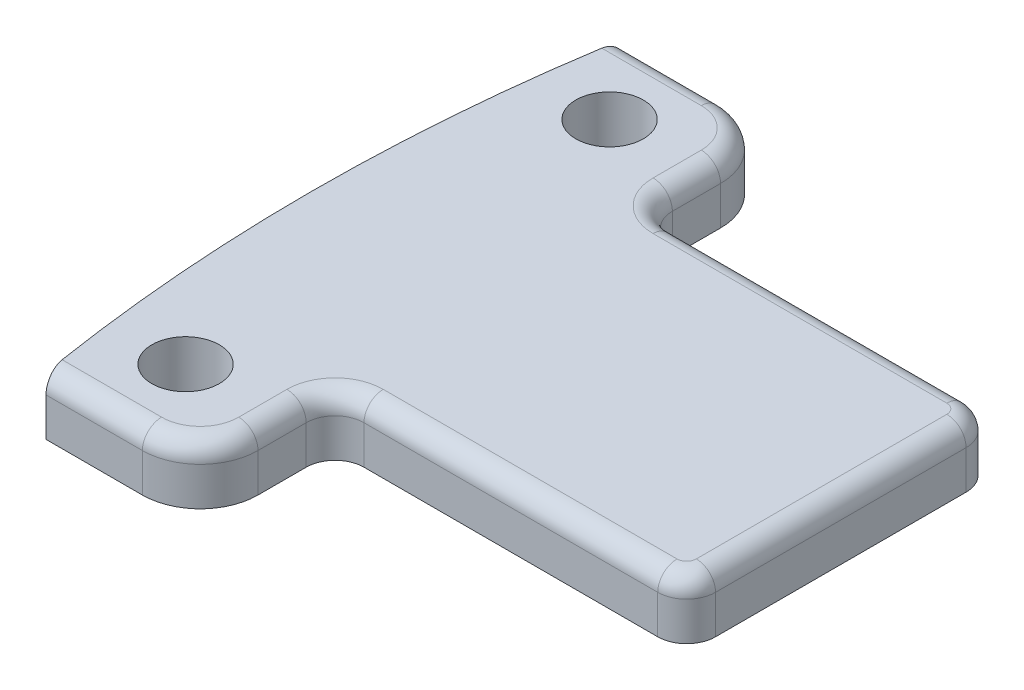
ISO-10303-21;
HEADER;
FILE_DESCRIPTION(('STEP AP214'),'2;1');
FILE_NAME('part.step','',(''),(''),'','','');
FILE_SCHEMA(('AUTOMOTIVE_DESIGN { 1 0 10303 214 1 1 1 1 }'));
ENDSEC;
DATA;
#1=APPLICATION_CONTEXT('core data for automotive mechanical design processes');
#2=APPLICATION_PROTOCOL_DEFINITION('international standard','automotive_design',2000,#1);
#3=PRODUCT_CONTEXT('',#1,'mechanical');
#4=PRODUCT('Part','Part','',(#3));
#5=PRODUCT_RELATED_PRODUCT_CATEGORY('part','',(#4));
#6=PRODUCT_DEFINITION_FORMATION('','',#4);
#7=PRODUCT_DEFINITION_CONTEXT('part definition',#1,'design');
#8=PRODUCT_DEFINITION('design','',#6,#7);
#9=PRODUCT_DEFINITION_SHAPE('','',#8);
#10=(LENGTH_UNIT() NAMED_UNIT(*) SI_UNIT(.MILLI.,.METRE.));
#11=(NAMED_UNIT(*) PLANE_ANGLE_UNIT() SI_UNIT($,.RADIAN.));
#12=(NAMED_UNIT(*) SI_UNIT($,.STERADIAN.) SOLID_ANGLE_UNIT());
#13=UNCERTAINTY_MEASURE_WITH_UNIT(LENGTH_MEASURE(1.E-05),#10,'distance_accuracy_value','');
#14=(GEOMETRIC_REPRESENTATION_CONTEXT(3) GLOBAL_UNCERTAINTY_ASSIGNED_CONTEXT((#13)) GLOBAL_UNIT_ASSIGNED_CONTEXT((#10,
#11,#12)) REPRESENTATION_CONTEXT('',''));
#15=CARTESIAN_POINT('',(0.,0.,0.));
#16=DIRECTION('',(0.,0.,1.));
#17=DIRECTION('',(1.,0.,0.));
#18=AXIS2_PLACEMENT_3D('',#15,#16,#17);
#19=CARTESIAN_POINT('',(76.25,3.,0.));
#20=DIRECTION('',(0.,-1.,0.));
#21=DIRECTION('',(0.,0.,-1.));
#22=AXIS2_PLACEMENT_3D('',#19,#20,#21);
#23=CYLINDRICAL_SURFACE('',#22,90.);
#24=DIRECTION('',(0.,-1.,0.));
#25=VECTOR('',#24,1.);
#26=CARTESIAN_POINT('',(-12.4911967464943,3.,15.));
#27=LINE('',#26,#25);
#28=CARTESIAN_POINT('',(-12.4911967464943,2.,15.));
#29=VERTEX_POINT('',#28);
#30=CARTESIAN_POINT('',(-12.4911967464943,0.,15.));
#31=VERTEX_POINT('',#30);
#32=EDGE_CURVE('E181',#29,#31,#27,.T.);
#33=ORIENTED_EDGE('',*,*,#32,.F.);
#34=CARTESIAN_POINT('',(-12.4911967464943,2.,15.));
#35=CARTESIAN_POINT('',(-12.4911966659108,2.02785477896124,15.0000000233222));
#36=CARTESIAN_POINT('',(-12.4913936046443,2.05569610633362,14.9988354202167));
#37=CARTESIAN_POINT('',(-12.4921785405438,2.11117720526927,14.9941907456337));
#38=CARTESIAN_POINT('',(-12.4927665073439,2.13881699231496,14.9907108539532));
#39=CARTESIAN_POINT('',(-12.4951093145208,2.22106584861728,14.9768376665104));
#40=CARTESIAN_POINT('',(-12.4974430889673,2.27512022540553,14.963010726559));
#41=CARTESIAN_POINT('',(-12.5035717204807,2.38010006922528,14.9266152599474));
#42=CARTESIAN_POINT('',(-12.507367067257,2.43102448090274,14.9040438033643));
#43=CARTESIAN_POINT('',(-12.5162848412924,2.52834435314858,14.8508383694509));
#44=CARTESIAN_POINT('',(-12.5214071916447,2.57474007596302,14.8202048593559));
#45=CARTESIAN_POINT('',(-12.5328407100056,2.66201669474693,14.7515561988088));
#46=CARTESIAN_POINT('',(-12.5391592251525,2.70286067528553,14.7134953809625));
#47=CARTESIAN_POINT('',(-12.5527558401695,2.777601696586,14.631209480911));
#48=CARTESIAN_POINT('',(-12.5600341544565,2.81149718073602,14.5869830211902));
#49=CARTESIAN_POINT('',(-12.5754198118407,2.87184300840901,14.4930014098814));
#50=CARTESIAN_POINT('',(-12.5835368508977,2.89818889560888,14.4431808420963));
#51=CARTESIAN_POINT('',(-12.6002661016059,2.94212977746345,14.3399073929856));
#52=CARTESIAN_POINT('',(-12.6088781041361,2.95972843791779,14.2864560439457));
#53=CARTESIAN_POINT('',(-12.6236906241228,2.98178722338334,14.1939633946626));
#54=CARTESIAN_POINT('',(-12.6298318080034,2.98861203884241,14.155459028148));
#55=CARTESIAN_POINT('',(-12.6421377015479,2.99771826037394,14.0779760559553));
#56=CARTESIAN_POINT('',(-12.6483023668059,3.00000595072572,14.0389981815682));
#57=CARTESIAN_POINT('',(-12.6544430835715,3.,14.));
#58=B_SPLINE_CURVE_WITH_KNOTS('',3,(#34,#35,#36,#37,#38,#39,#40,#41,#42,#43,#44,#45,#46,#47,#48,
#49,#50,#51,#52,#53,#54,#55,#56,#57),.UNSPECIFIED.,.F.,.F.,(4,2,2,2,2,2,2,2,2,2,2,4),(0.,
0.0835126445698617,0.167018804604846,0.33368814046195,0.500413368627903,0.667128936380208,
0.834903844124815,1.00271629606361,1.17274939532025,1.34271117666711,1.46121366241112,
1.57955189783363),.UNSPECIFIED.);
#59=CARTESIAN_POINT('',(-12.6544430835715,3.,14.));
#60=VERTEX_POINT('',#59);
#61=EDGE_CURVE('E305',#29,#60,#58,.T.);
#62=ORIENTED_EDGE('',*,*,#61,.T.);
#63=CARTESIAN_POINT('',(76.25,3.,0.));
#64=DIRECTION('',(0.,1.,0.));
#65=DIRECTION('',(0.,0.,1.));
#66=AXIS2_PLACEMENT_3D('',#63,#64,#65);
#67=CIRCLE('',#66,90.);
#68=CARTESIAN_POINT('',(-12.6544430835715,3.,-14.));
#69=VERTEX_POINT('',#68);
#70=EDGE_CURVE('E213',#69,#60,#67,.T.);
#71=ORIENTED_EDGE('',*,*,#70,.F.);
#72=CARTESIAN_POINT('',(-12.6544430835715,3.,-14.));
#73=CARTESIAN_POINT('',(-12.6454961836317,3.00004501724035,-14.0568293197316));
#74=CARTESIAN_POINT('',(-12.6364924667552,2.99515827955745,-14.1136378916832));
#75=CARTESIAN_POINT('',(-12.6186393252229,2.97585899265074,-14.2256126580707));
#76=CARTESIAN_POINT('',(-12.6097898322944,2.96145077435488,-14.2807795873052));
#77=CARTESIAN_POINT('',(-12.592499568113,2.92343492034262,-14.3879549834557));
#78=CARTESIAN_POINT('',(-12.5840590306323,2.89982209112893,-14.4399616480806));
#79=CARTESIAN_POINT('',(-12.5678588504873,2.84405244871153,-14.5392735588621));
#80=CARTESIAN_POINT('',(-12.5600990321173,2.81189784897555,-14.5865800186467));
#81=CARTESIAN_POINT('',(-12.5455487890973,2.74009550258546,-14.6748940043218));
#82=CARTESIAN_POINT('',(-12.538753760786,2.70048559372436,-14.7159315200897));
#83=CARTESIAN_POINT('',(-12.5263182619558,2.61475682986637,-14.7907659833607));
#84=CARTESIAN_POINT('',(-12.5206779801395,2.56863691311558,-14.824561747497));
#85=CARTESIAN_POINT('',(-12.5108149957427,2.4718060374903,-14.8835011613983));
#86=CARTESIAN_POINT('',(-12.5065759701042,2.42115736546043,-14.9087445301223));
#87=CARTESIAN_POINT('',(-12.499577941885,2.31625714384564,-14.9503466052577));
#88=CARTESIAN_POINT('',(-12.4968177780229,2.26200845891811,-14.9667122830335));
#89=CARTESIAN_POINT('',(-12.4936347863266,2.1727991347107,-14.9855709498781));
#90=CARTESIAN_POINT('',(-12.4927212934056,2.13844475545354,-14.9909786179401));
#91=CARTESIAN_POINT('',(-12.4915023054388,2.06939887598355,-14.9981923210448));
#92=CARTESIAN_POINT('',(-12.4911959463849,2.0347079255454,-15.0000034742715));
#93=CARTESIAN_POINT('',(-12.4911967464943,2.,-15.));
#94=B_SPLINE_CURVE_WITH_KNOTS('',3,(#72,#73,#74,#75,#76,#77,#78,#79,#80,#81,#82,#83,#84,#85,#86,
#87,#88,#89,#90,#91,#92,#93),.UNSPECIFIED.,.F.,.F.,(4,2,2,2,2,2,2,2,2,2,4),(0.,
0.172364750721056,0.344651153756528,0.517034906600273,0.689374032362402,0.860860987386369,
1.03237594357145,1.20181608516741,1.37112297756015,1.47531345099835,1.57935554487915),.UNSPECIFIED.);
#95=CARTESIAN_POINT('',(-12.4911967464943,2.,-15.));
#96=VERTEX_POINT('',#95);
#97=EDGE_CURVE('E298',#69,#96,#94,.T.);
#98=ORIENTED_EDGE('',*,*,#97,.T.);
#99=DIRECTION('',(0.,-1.,0.));
#100=VECTOR('',#99,1.);
#101=CARTESIAN_POINT('',(-12.4911967464943,3.,-15.));
#102=LINE('',#101,#100);
#103=CARTESIAN_POINT('',(-12.4911967464943,0.,-15.));
#104=VERTEX_POINT('',#103);
#105=EDGE_CURVE('E193',#96,#104,#102,.T.);
#106=ORIENTED_EDGE('',*,*,#105,.T.);
#107=CARTESIAN_POINT('',(76.25,0.,0.));
#108=DIRECTION('',(0.,1.,0.));
#109=DIRECTION('',(0.,0.,1.));
#110=AXIS2_PLACEMENT_3D('',#107,#108,#109);
#111=CIRCLE('',#110,90.);
#112=EDGE_CURVE('E199',#104,#31,#111,.T.);
#113=ORIENTED_EDGE('',*,*,#112,.T.);
#114=EDGE_LOOP('',(#33,#62,#71,#98,#106,#113));
#115=FACE_BOUND('',#114,.T.);
#116=ADVANCED_FACE('F35',(#115),#23,.T.);
#117=CARTESIAN_POINT('',(-12.4911967464943,3.,15.));
#118=DIRECTION('',(0.,0.,-1.));
#119=DIRECTION('',(-1.,0.,0.));
#120=AXIS2_PLACEMENT_3D('',#117,#118,#119);
#121=PLANE('',#120);
#122=DIRECTION('',(0.,-1.,0.));
#123=VECTOR('',#122,1.);
#124=CARTESIAN_POINT('',(-7.49119674649425,3.,15.));
#125=LINE('',#124,#123);
#126=CARTESIAN_POINT('',(-7.49119674649425,0.,15.));
#127=VERTEX_POINT('',#126);
#128=CARTESIAN_POINT('',(-7.49119674649425,2.,15.));
#129=VERTEX_POINT('',#128);
#130=EDGE_CURVE('E268',#127,#129,#125,.F.);
#131=ORIENTED_EDGE('',*,*,#130,.T.);
#132=DIRECTION('',(1.,0.,0.));
#133=VECTOR('',#132,1.);
#134=CARTESIAN_POINT('',(-12.4911967464943,2.,15.));
#135=LINE('',#134,#133);
#136=EDGE_CURVE('E188',#129,#29,#135,.F.);
#137=ORIENTED_EDGE('',*,*,#136,.T.);
#138=ORIENTED_EDGE('',*,*,#32,.T.);
#139=DIRECTION('',(1.,0.,0.));
#140=VECTOR('',#139,1.);
#141=CARTESIAN_POINT('',(-12.4911967464943,0.,15.));
#142=LINE('',#141,#140);
#143=EDGE_CURVE('E185',#31,#127,#142,.T.);
#144=ORIENTED_EDGE('',*,*,#143,.T.);
#145=EDGE_LOOP('',(#131,#137,#138,#144));
#146=FACE_BOUND('',#145,.T.);
#147=ADVANCED_FACE('F184',(#146),#121,.F.);
#148=CARTESIAN_POINT('',(-4.49119674649425,3.,8.));
#149=DIRECTION('',(-1.,0.,0.));
#150=DIRECTION('',(0.,0.,1.));
#151=AXIS2_PLACEMENT_3D('',#148,#149,#150);
#152=PLANE('',#151);
#153=DIRECTION('',(0.,-1.,0.));
#154=VECTOR('',#153,1.);
#155=CARTESIAN_POINT('',(-4.49119674649425,3.,9.5));
#156=LINE('',#155,#154);
#157=CARTESIAN_POINT('',(-4.49119674649425,0.,9.5));
#158=VERTEX_POINT('',#157);
#159=CARTESIAN_POINT('',(-4.49119674649425,2.,9.5));
#160=VERTEX_POINT('',#159);
#161=EDGE_CURVE('E242',#158,#160,#156,.F.);
#162=ORIENTED_EDGE('',*,*,#161,.T.);
#163=DIRECTION('',(0.,0.,-1.));
#164=VECTOR('',#163,1.);
#165=CARTESIAN_POINT('',(-4.49119674649425,2.,12.));
#166=LINE('',#165,#164);
#167=CARTESIAN_POINT('',(-4.49119674649425,2.,12.));
#168=VERTEX_POINT('',#167);
#169=EDGE_CURVE('E453',#160,#168,#166,.F.);
#170=ORIENTED_EDGE('',*,*,#169,.T.);
#171=DIRECTION('',(0.,-1.,0.));
#172=VECTOR('',#171,1.);
#173=CARTESIAN_POINT('',(-4.49119674649425,3.,12.));
#174=LINE('',#173,#172);
#175=CARTESIAN_POINT('',(-4.49119674649425,0.,12.));
#176=VERTEX_POINT('',#175);
#177=EDGE_CURVE('E266',#168,#176,#174,.T.);
#178=ORIENTED_EDGE('',*,*,#177,.T.);
#179=DIRECTION('',(0.,0.,-1.));
#180=VECTOR('',#179,1.);
#181=CARTESIAN_POINT('',(-4.49119674649425,0.,8.));
#182=LINE('',#181,#180);
#183=EDGE_CURVE('E203',#176,#158,#182,.T.);
#184=ORIENTED_EDGE('',*,*,#183,.T.);
#185=EDGE_LOOP('',(#162,#170,#178,#184));
#186=FACE_BOUND('',#185,.T.);
#187=ADVANCED_FACE('F520',(#186),#152,.F.);
#188=CARTESIAN_POINT('',(13.75,3.,8.));
#189=DIRECTION('',(0.,0.,-1.));
#190=DIRECTION('',(-1.,0.,0.));
#191=AXIS2_PLACEMENT_3D('',#188,#189,#190);
#192=PLANE('',#191);
#193=DIRECTION('',(0.,-1.,0.));
#194=VECTOR('',#193,1.);
#195=CARTESIAN_POINT('',(12.25,3.,8.));
#196=LINE('',#195,#194);
#197=CARTESIAN_POINT('',(12.25,0.,8.));
#198=VERTEX_POINT('',#197);
#199=CARTESIAN_POINT('',(12.25,2.,8.));
#200=VERTEX_POINT('',#199);
#201=EDGE_CURVE('E238',#198,#200,#196,.F.);
#202=ORIENTED_EDGE('',*,*,#201,.T.);
#203=DIRECTION('',(1.,0.,0.));
#204=VECTOR('',#203,1.);
#205=CARTESIAN_POINT('',(-2.99119674649426,2.,8.));
#206=LINE('',#205,#204);
#207=CARTESIAN_POINT('',(-2.99119674649425,2.,8.));
#208=VERTEX_POINT('',#207);
#209=EDGE_CURVE('E11',#200,#208,#206,.F.);
#210=ORIENTED_EDGE('',*,*,#209,.T.);
#211=DIRECTION('',(0.,-1.,0.));
#212=VECTOR('',#211,1.);
#213=CARTESIAN_POINT('',(-2.99119674649425,0.,8.));
#214=LINE('',#213,#212);
#215=CARTESIAN_POINT('',(-2.99119674649425,0.,8.));
#216=VERTEX_POINT('',#215);
#217=EDGE_CURVE('E240',#208,#216,#214,.T.);
#218=ORIENTED_EDGE('',*,*,#217,.T.);
#219=DIRECTION('',(1.,0.,0.));
#220=VECTOR('',#219,1.);
#221=CARTESIAN_POINT('',(13.75,0.,8.));
#222=LINE('',#221,#220);
#223=EDGE_CURVE('E217',#216,#198,#222,.T.);
#224=ORIENTED_EDGE('',*,*,#223,.T.);
#225=EDGE_LOOP('',(#202,#210,#218,#224));
#226=FACE_BOUND('',#225,.T.);
#227=ADVANCED_FACE('F518',(#226),#192,.F.);
#228=CARTESIAN_POINT('',(13.75,3.,-8.));
#229=DIRECTION('',(-1.,0.,0.));
#230=DIRECTION('',(0.,0.,1.));
#231=AXIS2_PLACEMENT_3D('',#228,#229,#230);
#232=PLANE('',#231);
#233=DIRECTION('',(0.,-1.,0.));
#234=VECTOR('',#233,1.);
#235=CARTESIAN_POINT('',(13.75,3.,-6.5));
#236=LINE('',#235,#234);
#237=CARTESIAN_POINT('',(13.75,0.,-6.5));
#238=VERTEX_POINT('',#237);
#239=CARTESIAN_POINT('',(13.75,2.,-6.5));
#240=VERTEX_POINT('',#239);
#241=EDGE_CURVE('E251',#238,#240,#236,.F.);
#242=ORIENTED_EDGE('',*,*,#241,.T.);
#243=DIRECTION('',(0.,0.,-1.));
#244=VECTOR('',#243,1.);
#245=CARTESIAN_POINT('',(13.75,2.,6.5));
#246=LINE('',#245,#244);
#247=CARTESIAN_POINT('',(13.75,2.,6.5));
#248=VERTEX_POINT('',#247);
#249=EDGE_CURVE('E60',#240,#248,#246,.F.);
#250=ORIENTED_EDGE('',*,*,#249,.T.);
#251=DIRECTION('',(0.,-1.,0.));
#252=VECTOR('',#251,1.);
#253=CARTESIAN_POINT('',(13.75,3.,6.5));
#254=LINE('',#253,#252);
#255=CARTESIAN_POINT('',(13.75,0.,6.5));
#256=VERTEX_POINT('',#255);
#257=EDGE_CURVE('E249',#248,#256,#254,.T.);
#258=ORIENTED_EDGE('',*,*,#257,.T.);
#259=DIRECTION('',(0.,0.,-1.));
#260=VECTOR('',#259,1.);
#261=CARTESIAN_POINT('',(13.75,0.,-8.));
#262=LINE('',#261,#260);
#263=EDGE_CURVE('E220',#256,#238,#262,.T.);
#264=ORIENTED_EDGE('',*,*,#263,.T.);
#265=EDGE_LOOP('',(#242,#250,#258,#264));
#266=FACE_BOUND('',#265,.T.);
#267=ADVANCED_FACE('F514',(#266),#232,.F.);
#268=CARTESIAN_POINT('',(-4.49119674649425,3.,-8.));
#269=DIRECTION('',(0.,0.,1.));
#270=DIRECTION('',(1.,0.,0.));
#271=AXIS2_PLACEMENT_3D('',#268,#269,#270);
#272=PLANE('',#271);
#273=DIRECTION('',(0.,-1.,0.));
#274=VECTOR('',#273,1.);
#275=CARTESIAN_POINT('',(-2.99119674649425,3.,-8.));
#276=LINE('',#275,#274);
#277=CARTESIAN_POINT('',(-2.99119674649425,0.,-8.));
#278=VERTEX_POINT('',#277);
#279=CARTESIAN_POINT('',(-2.99119674649425,2.,-8.));
#280=VERTEX_POINT('',#279);
#281=EDGE_CURVE('E235',#278,#280,#276,.F.);
#282=ORIENTED_EDGE('',*,*,#281,.T.);
#283=DIRECTION('',(-1.,0.,0.));
#284=VECTOR('',#283,1.);
#285=CARTESIAN_POINT('',(12.25,2.,-8.));
#286=LINE('',#285,#284);
#287=CARTESIAN_POINT('',(12.25,2.,-8.));
#288=VERTEX_POINT('',#287);
#289=EDGE_CURVE('E442',#280,#288,#286,.F.);
#290=ORIENTED_EDGE('',*,*,#289,.T.);
#291=DIRECTION('',(0.,-1.,0.));
#292=VECTOR('',#291,1.);
#293=CARTESIAN_POINT('',(12.25,3.,-8.));
#294=LINE('',#293,#292);
#295=CARTESIAN_POINT('',(12.25,0.,-8.));
#296=VERTEX_POINT('',#295);
#297=EDGE_CURVE('E233',#288,#296,#294,.T.);
#298=ORIENTED_EDGE('',*,*,#297,.T.);
#299=DIRECTION('',(-1.,0.,0.));
#300=VECTOR('',#299,1.);
#301=CARTESIAN_POINT('',(-4.49119674649425,0.,-8.));
#302=LINE('',#301,#300);
#303=EDGE_CURVE('E223',#296,#278,#302,.T.);
#304=ORIENTED_EDGE('',*,*,#303,.T.);
#305=EDGE_LOOP('',(#282,#290,#298,#304));
#306=FACE_BOUND('',#305,.T.);
#307=ADVANCED_FACE('F508',(#306),#272,.F.);
#308=CARTESIAN_POINT('',(-4.49119674649425,3.,-15.));
#309=DIRECTION('',(-1.,0.,0.));
#310=DIRECTION('',(0.,0.,1.));
#311=AXIS2_PLACEMENT_3D('',#308,#309,#310);
#312=PLANE('',#311);
#313=DIRECTION('',(0.,-1.,0.));
#314=VECTOR('',#313,1.);
#315=CARTESIAN_POINT('',(-4.49119674649425,3.,-12.));
#316=LINE('',#315,#314);
#317=CARTESIAN_POINT('',(-4.49119674649425,0.,-12.));
#318=VERTEX_POINT('',#317);
#319=CARTESIAN_POINT('',(-4.49119674649425,2.,-12.));
#320=VERTEX_POINT('',#319);
#321=EDGE_CURVE('E263',#318,#320,#316,.F.);
#322=ORIENTED_EDGE('',*,*,#321,.T.);
#323=DIRECTION('',(0.,0.,-1.));
#324=VECTOR('',#323,1.);
#325=CARTESIAN_POINT('',(-4.49119674649425,2.,-9.5));
#326=LINE('',#325,#324);
#327=CARTESIAN_POINT('',(-4.49119674649425,2.,-9.5));
#328=VERTEX_POINT('',#327);
#329=EDGE_CURVE('E446',#320,#328,#326,.F.);
#330=ORIENTED_EDGE('',*,*,#329,.T.);
#331=DIRECTION('',(0.,-1.,0.));
#332=VECTOR('',#331,1.);
#333=CARTESIAN_POINT('',(-4.49119674649425,0.,-9.5));
#334=LINE('',#333,#332);
#335=CARTESIAN_POINT('',(-4.49119674649425,0.,-9.5));
#336=VERTEX_POINT('',#335);
#337=EDGE_CURVE('E192',#328,#336,#334,.T.);
#338=ORIENTED_EDGE('',*,*,#337,.T.);
#339=DIRECTION('',(0.,0.,-1.));
#340=VECTOR('',#339,1.);
#341=CARTESIAN_POINT('',(-4.49119674649425,0.,-15.));
#342=LINE('',#341,#340);
#343=EDGE_CURVE('E226',#336,#318,#342,.T.);
#344=ORIENTED_EDGE('',*,*,#343,.T.);
#345=EDGE_LOOP('',(#322,#330,#338,#344));
#346=FACE_BOUND('',#345,.T.);
#347=ADVANCED_FACE('F491',(#346),#312,.F.);
#348=CARTESIAN_POINT('',(-12.4911967464943,3.,-15.));
#349=DIRECTION('',(0.,0.,1.));
#350=DIRECTION('',(1.,0.,0.));
#351=AXIS2_PLACEMENT_3D('',#348,#349,#350);
#352=PLANE('',#351);
#353=ORIENTED_EDGE('',*,*,#105,.F.);
#354=DIRECTION('',(-1.,0.,0.));
#355=VECTOR('',#354,1.);
#356=CARTESIAN_POINT('',(-7.49119674649425,2.,-15.));
#357=LINE('',#356,#355);
#358=CARTESIAN_POINT('',(-7.49119674649425,2.,-15.));
#359=VERTEX_POINT('',#358);
#360=EDGE_CURVE('E449',#96,#359,#357,.F.);
#361=ORIENTED_EDGE('',*,*,#360,.T.);
#362=DIRECTION('',(0.,-1.,0.));
#363=VECTOR('',#362,1.);
#364=CARTESIAN_POINT('',(-7.49119674649425,3.,-15.));
#365=LINE('',#364,#363);
#366=CARTESIAN_POINT('',(-7.49119674649425,0.,-15.));
#367=VERTEX_POINT('',#366);
#368=EDGE_CURVE('E258',#359,#367,#365,.T.);
#369=ORIENTED_EDGE('',*,*,#368,.T.);
#370=DIRECTION('',(-1.,0.,0.));
#371=VECTOR('',#370,1.);
#372=CARTESIAN_POINT('',(-12.4911967464943,0.,-15.));
#373=LINE('',#372,#371);
#374=EDGE_CURVE('E229',#367,#104,#373,.T.);
#375=ORIENTED_EDGE('',*,*,#374,.T.);
#376=EDGE_LOOP('',(#353,#361,#369,#375));
#377=FACE_BOUND('',#376,.T.);
#378=ADVANCED_FACE('F500',(#377),#352,.F.);
#379=CARTESIAN_POINT('',(76.25,3.,0.));
#380=DIRECTION('',(0.,1.,0.));
#381=DIRECTION('',(0.,0.,1.));
#382=AXIS2_PLACEMENT_3D('',#379,#380,#381);
#383=PLANE('',#382);
#384=ORIENTED_EDGE('',*,*,#70,.T.);
#385=DIRECTION('',(1.,0.,0.));
#386=VECTOR('',#385,1.);
#387=CARTESIAN_POINT('',(-7.49119674649425,3.,14.));
#388=LINE('',#387,#386);
#389=CARTESIAN_POINT('',(-7.49119674649425,3.,14.));
#390=VERTEX_POINT('',#389);
#391=EDGE_CURVE('E294',#60,#390,#388,.T.);
#392=ORIENTED_EDGE('',*,*,#391,.T.);
#393=CARTESIAN_POINT('',(-7.49119674649425,3.,12.));
#394=DIRECTION('',(0.,1.,0.));
#395=DIRECTION('',(0.,0.,1.));
#396=AXIS2_PLACEMENT_3D('',#393,#394,#395);
#397=CIRCLE('',#396,2.);
#398=CARTESIAN_POINT('',(-5.49119674649424,3.,12.));
#399=VERTEX_POINT('',#398);
#400=EDGE_CURVE('E292',#390,#399,#397,.T.);
#401=ORIENTED_EDGE('',*,*,#400,.T.);
#402=DIRECTION('',(0.,0.,-1.));
#403=VECTOR('',#402,1.);
#404=CARTESIAN_POINT('',(-5.49119674649424,3.,9.5));
#405=LINE('',#404,#403);
#406=CARTESIAN_POINT('',(-5.49119674649425,3.,9.5));
#407=VERTEX_POINT('',#406);
#408=EDGE_CURVE('E290',#399,#407,#405,.T.);
#409=ORIENTED_EDGE('',*,*,#408,.T.);
#410=CARTESIAN_POINT('',(-2.99119674649425,3.,9.5));
#411=DIRECTION('',(0.,1.,0.));
#412=DIRECTION('',(0.,0.,1.));
#413=AXIS2_PLACEMENT_3D('',#410,#411,#412);
#414=CIRCLE('',#413,2.5);
#415=CARTESIAN_POINT('',(-2.99119674649425,3.,7.));
#416=VERTEX_POINT('',#415);
#417=EDGE_CURVE('E288',#407,#416,#414,.F.);
#418=ORIENTED_EDGE('',*,*,#417,.T.);
#419=DIRECTION('',(1.,0.,0.));
#420=VECTOR('',#419,1.);
#421=CARTESIAN_POINT('',(12.25,3.,7.));
#422=LINE('',#421,#420);
#423=CARTESIAN_POINT('',(12.25,3.,7.));
#424=VERTEX_POINT('',#423);
#425=EDGE_CURVE('E270',#416,#424,#422,.T.);
#426=ORIENTED_EDGE('',*,*,#425,.T.);
#427=CARTESIAN_POINT('',(12.25,3.,6.5));
#428=DIRECTION('',(0.,1.,0.));
#429=DIRECTION('',(0.,0.,1.));
#430=AXIS2_PLACEMENT_3D('',#427,#428,#429);
#431=CIRCLE('',#430,0.5);
#432=CARTESIAN_POINT('',(12.75,3.,6.5));
#433=VERTEX_POINT('',#432);
#434=EDGE_CURVE('E272',#424,#433,#431,.T.);
#435=ORIENTED_EDGE('',*,*,#434,.T.);
#436=DIRECTION('',(0.,0.,-1.));
#437=VECTOR('',#436,1.);
#438=CARTESIAN_POINT('',(12.75,3.,-6.5));
#439=LINE('',#438,#437);
#440=CARTESIAN_POINT('',(12.75,3.,-6.5));
#441=VERTEX_POINT('',#440);
#442=EDGE_CURVE('E274',#433,#441,#439,.T.);
#443=ORIENTED_EDGE('',*,*,#442,.T.);
#444=CARTESIAN_POINT('',(12.25,3.,-6.5));
#445=DIRECTION('',(0.,1.,0.));
#446=DIRECTION('',(0.,0.,1.));
#447=AXIS2_PLACEMENT_3D('',#444,#445,#446);
#448=CIRCLE('',#447,0.5);
#449=CARTESIAN_POINT('',(12.25,3.,-7.));
#450=VERTEX_POINT('',#449);
#451=EDGE_CURVE('E276',#441,#450,#448,.T.);
#452=ORIENTED_EDGE('',*,*,#451,.T.);
#453=DIRECTION('',(-1.,0.,0.));
#454=VECTOR('',#453,1.);
#455=CARTESIAN_POINT('',(-2.99119674649426,3.,-7.));
#456=LINE('',#455,#454);
#457=CARTESIAN_POINT('',(-2.99119674649425,3.,-7.));
#458=VERTEX_POINT('',#457);
#459=EDGE_CURVE('E278',#450,#458,#456,.T.);
#460=ORIENTED_EDGE('',*,*,#459,.T.);
#461=CARTESIAN_POINT('',(-2.99119674649425,3.,-9.5));
#462=DIRECTION('',(0.,1.,0.));
#463=DIRECTION('',(0.,0.,1.));
#464=AXIS2_PLACEMENT_3D('',#461,#462,#463);
#465=CIRCLE('',#464,2.5);
#466=CARTESIAN_POINT('',(-5.49119674649425,3.,-9.5));
#467=VERTEX_POINT('',#466);
#468=EDGE_CURVE('E280',#458,#467,#465,.F.);
#469=ORIENTED_EDGE('',*,*,#468,.T.);
#470=DIRECTION('',(0.,0.,-1.));
#471=VECTOR('',#470,1.);
#472=CARTESIAN_POINT('',(-5.49119674649424,3.,-12.));
#473=LINE('',#472,#471);
#474=CARTESIAN_POINT('',(-5.49119674649424,3.,-12.));
#475=VERTEX_POINT('',#474);
#476=EDGE_CURVE('E282',#467,#475,#473,.T.);
#477=ORIENTED_EDGE('',*,*,#476,.T.);
#478=CARTESIAN_POINT('',(-7.49119674649425,3.,-12.));
#479=DIRECTION('',(0.,1.,0.));
#480=DIRECTION('',(0.,0.,1.));
#481=AXIS2_PLACEMENT_3D('',#478,#479,#480);
#482=CIRCLE('',#481,2.);
#483=CARTESIAN_POINT('',(-7.49119674649425,3.,-14.));
#484=VERTEX_POINT('',#483);
#485=EDGE_CURVE('E284',#475,#484,#482,.T.);
#486=ORIENTED_EDGE('',*,*,#485,.T.);
#487=DIRECTION('',(-1.,0.,0.));
#488=VECTOR('',#487,1.);
#489=CARTESIAN_POINT('',(-12.4911967464943,3.,-14.));
#490=LINE('',#489,#488);
#491=EDGE_CURVE('E286',#484,#69,#490,.T.);
#492=ORIENTED_EDGE('',*,*,#491,.T.);
#493=EDGE_LOOP('',(#384,#392,#401,#409,#418,#426,#435,#443,#452,#460,#469,#477,#486,#492));
#494=FACE_BOUND('',#493,.T.);
#495=CARTESIAN_POINT('',(-9.25,3.,11.));
#496=DIRECTION('',(0.,-1.,0.));
#497=DIRECTION('',(0.,0.,-1.));
#498=AXIS2_PLACEMENT_3D('',#495,#496,#497);
#499=CIRCLE('',#498,1.75);
#500=CARTESIAN_POINT('',(-9.25,3.,9.25));
#501=VERTEX_POINT('',#500);
#502=EDGE_CURVE('E401',#501,#501,#499,.T.);
#503=ORIENTED_EDGE('',*,*,#502,.T.);
#504=EDGE_LOOP('',(#503));
#505=FACE_BOUND('',#504,.T.);
#506=CARTESIAN_POINT('',(-9.25,3.,-11.));
#507=DIRECTION('',(0.,1.,0.));
#508=DIRECTION('',(0.,0.,1.));
#509=AXIS2_PLACEMENT_3D('',#506,#507,#508);
#510=CIRCLE('',#509,1.75);
#511=CARTESIAN_POINT('',(-9.25,3.,-9.25));
#512=VERTEX_POINT('',#511);
#513=EDGE_CURVE('E210',#512,#512,#510,.T.);
#514=ORIENTED_EDGE('',*,*,#513,.F.);
#515=EDGE_LOOP('',(#514));
#516=FACE_BOUND('',#515,.T.);
#517=ADVANCED_FACE('F462',(#494,#505,#516),#383,.T.);
#518=CARTESIAN_POINT('',(76.25,0.,0.));
#519=DIRECTION('',(0.,1.,0.));
#520=DIRECTION('',(0.,0.,1.));
#521=AXIS2_PLACEMENT_3D('',#518,#519,#520);
#522=PLANE('',#521);
#523=CARTESIAN_POINT('',(-9.25,0.,11.));
#524=DIRECTION('',(0.,-1.,0.));
#525=DIRECTION('',(0.,0.,-1.));
#526=AXIS2_PLACEMENT_3D('',#523,#524,#525);
#527=CIRCLE('',#526,1.75);
#528=CARTESIAN_POINT('',(-9.25,0.,9.25));
#529=VERTEX_POINT('',#528);
#530=EDGE_CURVE('E404',#529,#529,#527,.T.);
#531=ORIENTED_EDGE('',*,*,#530,.F.);
#532=EDGE_LOOP('',(#531));
#533=FACE_BOUND('',#532,.T.);
#534=CARTESIAN_POINT('',(-9.25,0.,-11.));
#535=DIRECTION('',(0.,1.,0.));
#536=DIRECTION('',(0.,0.,1.));
#537=AXIS2_PLACEMENT_3D('',#534,#535,#536);
#538=CIRCLE('',#537,1.75);
#539=CARTESIAN_POINT('',(-9.25,0.,-9.25));
#540=VERTEX_POINT('',#539);
#541=EDGE_CURVE('E207',#540,#540,#538,.T.);
#542=ORIENTED_EDGE('',*,*,#541,.T.);
#543=EDGE_LOOP('',(#542));
#544=FACE_BOUND('',#543,.T.);
#545=ORIENTED_EDGE('',*,*,#374,.F.);
#546=CARTESIAN_POINT('',(-7.49119674649425,0.,-12.));
#547=DIRECTION('',(0.,1.,0.));
#548=DIRECTION('',(0.,0.,1.));
#549=AXIS2_PLACEMENT_3D('',#546,#547,#548);
#550=CIRCLE('',#549,3.);
#551=EDGE_CURVE('E261',#367,#318,#550,.F.);
#552=ORIENTED_EDGE('',*,*,#551,.T.);
#553=ORIENTED_EDGE('',*,*,#343,.F.);
#554=CARTESIAN_POINT('',(-2.99119674649425,0.,-9.5));
#555=DIRECTION('',(0.,1.,0.));
#556=DIRECTION('',(0.,0.,1.));
#557=AXIS2_PLACEMENT_3D('',#554,#555,#556);
#558=CIRCLE('',#557,1.5);
#559=EDGE_CURVE('E253',#336,#278,#558,.T.);
#560=ORIENTED_EDGE('',*,*,#559,.T.);
#561=ORIENTED_EDGE('',*,*,#303,.F.);
#562=CARTESIAN_POINT('',(12.25,0.,-6.5));
#563=DIRECTION('',(0.,1.,0.));
#564=DIRECTION('',(0.,0.,1.));
#565=AXIS2_PLACEMENT_3D('',#562,#563,#564);
#566=CIRCLE('',#565,1.5);
#567=EDGE_CURVE('E247',#296,#238,#566,.F.);
#568=ORIENTED_EDGE('',*,*,#567,.T.);
#569=ORIENTED_EDGE('',*,*,#263,.F.);
#570=CARTESIAN_POINT('',(12.25,0.,6.5));
#571=DIRECTION('',(0.,1.,0.));
#572=DIRECTION('',(0.,0.,1.));
#573=AXIS2_PLACEMENT_3D('',#570,#571,#572);
#574=CIRCLE('',#573,1.5);
#575=EDGE_CURVE('E245',#256,#198,#574,.F.);
#576=ORIENTED_EDGE('',*,*,#575,.T.);
#577=ORIENTED_EDGE('',*,*,#223,.F.);
#578=CARTESIAN_POINT('',(-2.99119674649425,0.,9.5));
#579=DIRECTION('',(0.,1.,0.));
#580=DIRECTION('',(0.,0.,1.));
#581=AXIS2_PLACEMENT_3D('',#578,#579,#580);
#582=CIRCLE('',#581,1.5);
#583=EDGE_CURVE('E255',#216,#158,#582,.T.);
#584=ORIENTED_EDGE('',*,*,#583,.T.);
#585=ORIENTED_EDGE('',*,*,#183,.F.);
#586=CARTESIAN_POINT('',(-7.49119674649425,0.,12.));
#587=DIRECTION('',(0.,1.,0.));
#588=DIRECTION('',(0.,0.,1.));
#589=AXIS2_PLACEMENT_3D('',#586,#587,#588);
#590=CIRCLE('',#589,3.);
#591=EDGE_CURVE('E202',#176,#127,#590,.F.);
#592=ORIENTED_EDGE('',*,*,#591,.T.);
#593=ORIENTED_EDGE('',*,*,#143,.F.);
#594=ORIENTED_EDGE('',*,*,#112,.F.);
#595=EDGE_LOOP('',(#545,#552,#553,#560,#561,#568,#569,#576,#577,#584,#585,#592,#593,#594));
#596=FACE_BOUND('',#595,.T.);
#597=ADVANCED_FACE('F198',(#533,#544,#596),#522,.F.);
#598=CARTESIAN_POINT('',(-9.25,0.,-11.));
#599=DIRECTION('',(0.,1.,0.));
#600=DIRECTION('',(0.,0.,1.));
#601=AXIS2_PLACEMENT_3D('',#598,#599,#600);
#602=CYLINDRICAL_SURFACE('',#601,1.75);
#603=ORIENTED_EDGE('',*,*,#541,.F.);
#604=EDGE_LOOP('',(#603));
#605=FACE_BOUND('',#604,.T.);
#606=ORIENTED_EDGE('',*,*,#513,.T.);
#607=EDGE_LOOP('',(#606));
#608=FACE_BOUND('',#607,.T.);
#609=ADVANCED_FACE('F551',(#605,#608),#602,.F.);
#610=CARTESIAN_POINT('',(-9.25,0.,11.));
#611=DIRECTION('',(0.,1.,0.));
#612=DIRECTION('',(0.,0.,1.));
#613=AXIS2_PLACEMENT_3D('',#610,#611,#612);
#614=CYLINDRICAL_SURFACE('',#613,1.75);
#615=ORIENTED_EDGE('',*,*,#530,.T.);
#616=EDGE_LOOP('',(#615));
#617=FACE_BOUND('',#616,.T.);
#618=ORIENTED_EDGE('',*,*,#502,.F.);
#619=EDGE_LOOP('',(#618));
#620=FACE_BOUND('',#619,.T.);
#621=ADVANCED_FACE('F322',(#617,#620),#614,.F.);
#622=CARTESIAN_POINT('',(-2.99119674649425,3.,-9.5));
#623=DIRECTION('',(0.,1.,0.));
#624=DIRECTION('',(0.,0.,1.));
#625=AXIS2_PLACEMENT_3D('',#622,#623,#624);
#626=CYLINDRICAL_SURFACE('',#625,1.5);
#627=ORIENTED_EDGE('',*,*,#337,.F.);
#628=CARTESIAN_POINT('',(-2.99119674649425,2.,-9.5));
#629=DIRECTION('',(0.,1.,0.));
#630=DIRECTION('',(0.,0.,1.));
#631=AXIS2_PLACEMENT_3D('',#628,#629,#630);
#632=CIRCLE('',#631,1.5);
#633=EDGE_CURVE('E444',#328,#280,#632,.T.);
#634=ORIENTED_EDGE('',*,*,#633,.T.);
#635=ORIENTED_EDGE('',*,*,#281,.F.);
#636=ORIENTED_EDGE('',*,*,#559,.F.);
#637=EDGE_LOOP('',(#627,#634,#635,#636));
#638=FACE_BOUND('',#637,.T.);
#639=ADVANCED_FACE('F317',(#638),#626,.F.);
#640=CARTESIAN_POINT('',(-2.99119674649425,3.,9.5));
#641=DIRECTION('',(0.,1.,0.));
#642=DIRECTION('',(0.,0.,1.));
#643=AXIS2_PLACEMENT_3D('',#640,#641,#642);
#644=CYLINDRICAL_SURFACE('',#643,1.5);
#645=ORIENTED_EDGE('',*,*,#217,.F.);
#646=CARTESIAN_POINT('',(-2.99119674649425,2.,9.5));
#647=DIRECTION('',(0.,1.,0.));
#648=DIRECTION('',(0.,0.,1.));
#649=AXIS2_PLACEMENT_3D('',#646,#647,#648);
#650=CIRCLE('',#649,1.5);
#651=EDGE_CURVE('E451',#208,#160,#650,.T.);
#652=ORIENTED_EDGE('',*,*,#651,.T.);
#653=ORIENTED_EDGE('',*,*,#161,.F.);
#654=ORIENTED_EDGE('',*,*,#583,.F.);
#655=EDGE_LOOP('',(#645,#652,#653,#654));
#656=FACE_BOUND('',#655,.T.);
#657=ADVANCED_FACE('F321',(#656),#644,.F.);
#658=CARTESIAN_POINT('',(12.25,3.,-6.5));
#659=DIRECTION('',(0.,-1.,0.));
#660=DIRECTION('',(0.,0.,-1.));
#661=AXIS2_PLACEMENT_3D('',#658,#659,#660);
#662=CYLINDRICAL_SURFACE('',#661,1.5);
#663=ORIENTED_EDGE('',*,*,#297,.F.);
#664=CARTESIAN_POINT('',(12.25,2.,-6.5));
#665=DIRECTION('',(0.,1.,0.));
#666=DIRECTION('',(0.,0.,1.));
#667=AXIS2_PLACEMENT_3D('',#664,#665,#666);
#668=CIRCLE('',#667,1.5);
#669=EDGE_CURVE('E440',#288,#240,#668,.F.);
#670=ORIENTED_EDGE('',*,*,#669,.T.);
#671=ORIENTED_EDGE('',*,*,#241,.F.);
#672=ORIENTED_EDGE('',*,*,#567,.F.);
#673=EDGE_LOOP('',(#663,#670,#671,#672));
#674=FACE_BOUND('',#673,.T.);
#675=ADVANCED_FACE('F326',(#674),#662,.T.);
#676=CARTESIAN_POINT('',(12.25,3.,6.5));
#677=DIRECTION('',(0.,-1.,0.));
#678=DIRECTION('',(0.,0.,-1.));
#679=AXIS2_PLACEMENT_3D('',#676,#677,#678);
#680=CYLINDRICAL_SURFACE('',#679,1.5);
#681=ORIENTED_EDGE('',*,*,#257,.F.);
#682=CARTESIAN_POINT('',(12.25,2.,6.5));
#683=DIRECTION('',(0.,1.,0.));
#684=DIRECTION('',(0.,0.,1.));
#685=AXIS2_PLACEMENT_3D('',#682,#683,#684);
#686=CIRCLE('',#685,1.5);
#687=EDGE_CURVE('E45',#248,#200,#686,.F.);
#688=ORIENTED_EDGE('',*,*,#687,.T.);
#689=ORIENTED_EDGE('',*,*,#201,.F.);
#690=ORIENTED_EDGE('',*,*,#575,.F.);
#691=EDGE_LOOP('',(#681,#688,#689,#690));
#692=FACE_BOUND('',#691,.T.);
#693=ADVANCED_FACE('F330',(#692),#680,.T.);
#694=CARTESIAN_POINT('',(-7.49119674649425,3.,-12.));
#695=DIRECTION('',(0.,-1.,0.));
#696=DIRECTION('',(0.,0.,-1.));
#697=AXIS2_PLACEMENT_3D('',#694,#695,#696);
#698=CYLINDRICAL_SURFACE('',#697,3.);
#699=ORIENTED_EDGE('',*,*,#368,.F.);
#700=CARTESIAN_POINT('',(-7.49119674649425,2.,-12.));
#701=DIRECTION('',(0.,1.,0.));
#702=DIRECTION('',(0.,0.,1.));
#703=AXIS2_PLACEMENT_3D('',#700,#701,#702);
#704=CIRCLE('',#703,3.);
#705=EDGE_CURVE('E398',#359,#320,#704,.F.);
#706=ORIENTED_EDGE('',*,*,#705,.T.);
#707=ORIENTED_EDGE('',*,*,#321,.F.);
#708=ORIENTED_EDGE('',*,*,#551,.F.);
#709=EDGE_LOOP('',(#699,#706,#707,#708));
#710=FACE_BOUND('',#709,.T.);
#711=ADVANCED_FACE('F334',(#710),#698,.T.);
#712=CARTESIAN_POINT('',(-7.49119674649425,3.,12.));
#713=DIRECTION('',(0.,-1.,0.));
#714=DIRECTION('',(0.,0.,-1.));
#715=AXIS2_PLACEMENT_3D('',#712,#713,#714);
#716=CYLINDRICAL_SURFACE('',#715,3.);
#717=ORIENTED_EDGE('',*,*,#177,.F.);
#718=CARTESIAN_POINT('',(-7.49119674649425,2.,12.));
#719=DIRECTION('',(0.,1.,0.));
#720=DIRECTION('',(0.,0.,1.));
#721=AXIS2_PLACEMENT_3D('',#718,#719,#720);
#722=CIRCLE('',#721,3.);
#723=EDGE_CURVE('E454',#168,#129,#722,.F.);
#724=ORIENTED_EDGE('',*,*,#723,.T.);
#725=ORIENTED_EDGE('',*,*,#130,.F.);
#726=ORIENTED_EDGE('',*,*,#591,.F.);
#727=EDGE_LOOP('',(#717,#724,#725,#726));
#728=FACE_BOUND('',#727,.T.);
#729=ADVANCED_FACE('F337',(#728),#716,.T.);
#730=CARTESIAN_POINT('',(76.25,2.,-14.));
#731=DIRECTION('',(1.,0.,0.));
#732=DIRECTION('',(0.,0.,-1.));
#733=AXIS2_PLACEMENT_3D('',#730,#731,#732);
#734=CYLINDRICAL_SURFACE('',#733,1.);
#735=ORIENTED_EDGE('',*,*,#97,.F.);
#736=ORIENTED_EDGE('',*,*,#491,.F.);
#737=CARTESIAN_POINT('',(-7.49119674649425,2.,-14.));
#738=DIRECTION('',(1.,0.,0.));
#739=DIRECTION('',(0.,0.,-1.));
#740=AXIS2_PLACEMENT_3D('',#737,#738,#739);
#741=CIRCLE('',#740,1.);
#742=EDGE_CURVE('E40',#359,#484,#741,.T.);
#743=ORIENTED_EDGE('',*,*,#742,.F.);
#744=ORIENTED_EDGE('',*,*,#360,.F.);
#745=EDGE_LOOP('',(#735,#736,#743,#744));
#746=FACE_BOUND('',#745,.T.);
#747=ADVANCED_FACE('F37',(#746),#734,.T.);
#748=CARTESIAN_POINT('',(-7.49119674649425,2.,-12.));
#749=DIRECTION('',(0.,1.,0.));
#750=DIRECTION('',(0.,0.,1.));
#751=AXIS2_PLACEMENT_3D('',#748,#749,#750);
#752=TOROIDAL_SURFACE('',#751,2.,1.);
#753=ORIENTED_EDGE('',*,*,#742,.T.);
#754=ORIENTED_EDGE('',*,*,#485,.F.);
#755=CARTESIAN_POINT('',(-5.49119674649425,2.,-12.));
#756=DIRECTION('',(0.,0.,1.));
#757=DIRECTION('',(1.,0.,0.));
#758=AXIS2_PLACEMENT_3D('',#755,#756,#757);
#759=CIRCLE('',#758,1.);
#760=EDGE_CURVE('E402',#320,#475,#759,.T.);
#761=ORIENTED_EDGE('',*,*,#760,.F.);
#762=ORIENTED_EDGE('',*,*,#705,.F.);
#763=EDGE_LOOP('',(#753,#754,#761,#762));
#764=FACE_BOUND('',#763,.T.);
#765=ADVANCED_FACE('F384',(#764),#752,.T.);
#766=CARTESIAN_POINT('',(-5.49119674649425,2.,0.));
#767=DIRECTION('',(0.,0.,1.));
#768=DIRECTION('',(1.,0.,0.));
#769=AXIS2_PLACEMENT_3D('',#766,#767,#768);
#770=CYLINDRICAL_SURFACE('',#769,1.);
#771=ORIENTED_EDGE('',*,*,#760,.T.);
#772=ORIENTED_EDGE('',*,*,#476,.F.);
#773=CARTESIAN_POINT('',(-5.49119674649425,2.,-9.5));
#774=DIRECTION('',(0.,0.,1.));
#775=DIRECTION('',(1.,0.,0.));
#776=AXIS2_PLACEMENT_3D('',#773,#774,#775);
#777=CIRCLE('',#776,1.);
#778=EDGE_CURVE('E406',#328,#467,#777,.T.);
#779=ORIENTED_EDGE('',*,*,#778,.F.);
#780=ORIENTED_EDGE('',*,*,#329,.F.);
#781=EDGE_LOOP('',(#771,#772,#779,#780));
#782=FACE_BOUND('',#781,.T.);
#783=ADVANCED_FACE('F381',(#782),#770,.T.);
#784=CARTESIAN_POINT('',(-2.99119674649425,2.,-9.5));
#785=DIRECTION('',(0.,1.,0.));
#786=DIRECTION('',(0.,0.,1.));
#787=AXIS2_PLACEMENT_3D('',#784,#785,#786);
#788=TOROIDAL_SURFACE('',#787,2.5,1.);
#789=ORIENTED_EDGE('',*,*,#778,.T.);
#790=ORIENTED_EDGE('',*,*,#468,.F.);
#791=CARTESIAN_POINT('',(-2.99119674649425,2.,-7.));
#792=DIRECTION('',(1.,0.,0.));
#793=DIRECTION('',(0.,0.,-1.));
#794=AXIS2_PLACEMENT_3D('',#791,#792,#793);
#795=CIRCLE('',#794,1.);
#796=EDGE_CURVE('E410',#280,#458,#795,.T.);
#797=ORIENTED_EDGE('',*,*,#796,.F.);
#798=ORIENTED_EDGE('',*,*,#633,.F.);
#799=EDGE_LOOP('',(#789,#790,#797,#798));
#800=FACE_BOUND('',#799,.T.);
#801=ADVANCED_FACE('F377',(#800),#788,.T.);
#802=CARTESIAN_POINT('',(76.25,2.,-6.99999999999999));
#803=DIRECTION('',(1.,0.,0.));
#804=DIRECTION('',(0.,0.,-1.));
#805=AXIS2_PLACEMENT_3D('',#802,#803,#804);
#806=CYLINDRICAL_SURFACE('',#805,1.);
#807=ORIENTED_EDGE('',*,*,#796,.T.);
#808=ORIENTED_EDGE('',*,*,#459,.F.);
#809=CARTESIAN_POINT('',(12.25,2.,-7.));
#810=DIRECTION('',(1.,0.,0.));
#811=DIRECTION('',(0.,0.,-1.));
#812=AXIS2_PLACEMENT_3D('',#809,#810,#811);
#813=CIRCLE('',#812,1.);
#814=EDGE_CURVE('E415',#288,#450,#813,.T.);
#815=ORIENTED_EDGE('',*,*,#814,.F.);
#816=ORIENTED_EDGE('',*,*,#289,.F.);
#817=EDGE_LOOP('',(#807,#808,#815,#816));
#818=FACE_BOUND('',#817,.T.);
#819=ADVANCED_FACE('F373',(#818),#806,.T.);
#820=CARTESIAN_POINT('',(12.25,2.,-6.5));
#821=DIRECTION('',(0.,1.,0.));
#822=DIRECTION('',(0.,0.,1.));
#823=AXIS2_PLACEMENT_3D('',#820,#821,#822);
#824=DEGENERATE_TOROIDAL_SURFACE('',#823,0.5,1.,.T.);
#825=ORIENTED_EDGE('',*,*,#814,.T.);
#826=ORIENTED_EDGE('',*,*,#451,.F.);
#827=CARTESIAN_POINT('',(12.75,2.,-6.5));
#828=DIRECTION('',(0.,0.,1.));
#829=DIRECTION('',(1.,0.,0.));
#830=AXIS2_PLACEMENT_3D('',#827,#828,#829);
#831=CIRCLE('',#830,1.);
#832=EDGE_CURVE('E418',#240,#441,#831,.T.);
#833=ORIENTED_EDGE('',*,*,#832,.F.);
#834=ORIENTED_EDGE('',*,*,#669,.F.);
#835=EDGE_LOOP('',(#825,#826,#833,#834));
#836=FACE_BOUND('',#835,.T.);
#837=ADVANCED_FACE('F369',(#836),#824,.T.);
#838=CARTESIAN_POINT('',(12.75,2.,0.));
#839=DIRECTION('',(0.,0.,1.));
#840=DIRECTION('',(1.,0.,0.));
#841=AXIS2_PLACEMENT_3D('',#838,#839,#840);
#842=CYLINDRICAL_SURFACE('',#841,1.);
#843=ORIENTED_EDGE('',*,*,#832,.T.);
#844=ORIENTED_EDGE('',*,*,#442,.F.);
#845=CARTESIAN_POINT('',(12.75,2.,6.5));
#846=DIRECTION('',(0.,0.,1.));
#847=DIRECTION('',(1.,0.,0.));
#848=AXIS2_PLACEMENT_3D('',#845,#846,#847);
#849=CIRCLE('',#848,1.);
#850=EDGE_CURVE('E421',#248,#433,#849,.T.);
#851=ORIENTED_EDGE('',*,*,#850,.F.);
#852=ORIENTED_EDGE('',*,*,#249,.F.);
#853=EDGE_LOOP('',(#843,#844,#851,#852));
#854=FACE_BOUND('',#853,.T.);
#855=ADVANCED_FACE('F365',(#854),#842,.T.);
#856=CARTESIAN_POINT('',(12.25,2.,6.5));
#857=DIRECTION('',(0.,1.,0.));
#858=DIRECTION('',(0.,0.,1.));
#859=AXIS2_PLACEMENT_3D('',#856,#857,#858);
#860=DEGENERATE_TOROIDAL_SURFACE('',#859,0.5,1.,.T.);
#861=ORIENTED_EDGE('',*,*,#850,.T.);
#862=ORIENTED_EDGE('',*,*,#434,.F.);
#863=CARTESIAN_POINT('',(12.25,2.,7.));
#864=DIRECTION('',(-1.,0.,0.));
#865=DIRECTION('',(0.,0.,1.));
#866=AXIS2_PLACEMENT_3D('',#863,#864,#865);
#867=CIRCLE('',#866,1.);
#868=EDGE_CURVE('E424',#200,#424,#867,.T.);
#869=ORIENTED_EDGE('',*,*,#868,.F.);
#870=ORIENTED_EDGE('',*,*,#687,.F.);
#871=EDGE_LOOP('',(#861,#862,#869,#870));
#872=FACE_BOUND('',#871,.T.);
#873=ADVANCED_FACE('F361',(#872),#860,.T.);
#874=CARTESIAN_POINT('',(76.25,2.,6.99999999999999));
#875=DIRECTION('',(-1.,0.,0.));
#876=DIRECTION('',(0.,0.,1.));
#877=AXIS2_PLACEMENT_3D('',#874,#875,#876);
#878=CYLINDRICAL_SURFACE('',#877,1.);
#879=ORIENTED_EDGE('',*,*,#868,.T.);
#880=ORIENTED_EDGE('',*,*,#425,.F.);
#881=CARTESIAN_POINT('',(-2.99119674649425,2.,7.));
#882=DIRECTION('',(-1.,0.,0.));
#883=DIRECTION('',(0.,0.,1.));
#884=AXIS2_PLACEMENT_3D('',#881,#882,#883);
#885=CIRCLE('',#884,1.);
#886=EDGE_CURVE('E427',#208,#416,#885,.T.);
#887=ORIENTED_EDGE('',*,*,#886,.F.);
#888=ORIENTED_EDGE('',*,*,#209,.F.);
#889=EDGE_LOOP('',(#879,#880,#887,#888));
#890=FACE_BOUND('',#889,.T.);
#891=ADVANCED_FACE('F357',(#890),#878,.T.);
#892=CARTESIAN_POINT('',(-2.99119674649425,2.,9.5));
#893=DIRECTION('',(0.,1.,0.));
#894=DIRECTION('',(0.,0.,1.));
#895=AXIS2_PLACEMENT_3D('',#892,#893,#894);
#896=TOROIDAL_SURFACE('',#895,2.5,1.);
#897=ORIENTED_EDGE('',*,*,#886,.T.);
#898=ORIENTED_EDGE('',*,*,#417,.F.);
#899=CARTESIAN_POINT('',(-5.49119674649425,2.,9.5));
#900=DIRECTION('',(0.,0.,1.));
#901=DIRECTION('',(1.,0.,0.));
#902=AXIS2_PLACEMENT_3D('',#899,#900,#901);
#903=CIRCLE('',#902,1.);
#904=EDGE_CURVE('E430',#160,#407,#903,.T.);
#905=ORIENTED_EDGE('',*,*,#904,.F.);
#906=ORIENTED_EDGE('',*,*,#651,.F.);
#907=EDGE_LOOP('',(#897,#898,#905,#906));
#908=FACE_BOUND('',#907,.T.);
#909=ADVANCED_FACE('F353',(#908),#896,.T.);
#910=CARTESIAN_POINT('',(-5.49119674649425,2.,0.));
#911=DIRECTION('',(0.,0.,1.));
#912=DIRECTION('',(1.,0.,0.));
#913=AXIS2_PLACEMENT_3D('',#910,#911,#912);
#914=CYLINDRICAL_SURFACE('',#913,1.);
#915=ORIENTED_EDGE('',*,*,#904,.T.);
#916=ORIENTED_EDGE('',*,*,#408,.F.);
#917=CARTESIAN_POINT('',(-5.49119674649425,2.,12.));
#918=DIRECTION('',(0.,0.,1.));
#919=DIRECTION('',(1.,0.,0.));
#920=AXIS2_PLACEMENT_3D('',#917,#918,#919);
#921=CIRCLE('',#920,1.);
#922=EDGE_CURVE('E433',#168,#399,#921,.T.);
#923=ORIENTED_EDGE('',*,*,#922,.F.);
#924=ORIENTED_EDGE('',*,*,#169,.F.);
#925=EDGE_LOOP('',(#915,#916,#923,#924));
#926=FACE_BOUND('',#925,.T.);
#927=ADVANCED_FACE('F349',(#926),#914,.T.);
#928=CARTESIAN_POINT('',(-7.49119674649425,2.,12.));
#929=DIRECTION('',(0.,1.,0.));
#930=DIRECTION('',(0.,0.,1.));
#931=AXIS2_PLACEMENT_3D('',#928,#929,#930);
#932=TOROIDAL_SURFACE('',#931,2.,1.);
#933=ORIENTED_EDGE('',*,*,#922,.T.);
#934=ORIENTED_EDGE('',*,*,#400,.F.);
#935=CARTESIAN_POINT('',(-7.49119674649425,2.,14.));
#936=DIRECTION('',(-1.,0.,0.));
#937=DIRECTION('',(0.,0.,1.));
#938=AXIS2_PLACEMENT_3D('',#935,#936,#937);
#939=CIRCLE('',#938,1.);
#940=EDGE_CURVE('E436',#129,#390,#939,.T.);
#941=ORIENTED_EDGE('',*,*,#940,.F.);
#942=ORIENTED_EDGE('',*,*,#723,.F.);
#943=EDGE_LOOP('',(#933,#934,#941,#942));
#944=FACE_BOUND('',#943,.T.);
#945=ADVANCED_FACE('F345',(#944),#932,.T.);
#946=CARTESIAN_POINT('',(76.25,2.,14.));
#947=DIRECTION('',(-1.,0.,0.));
#948=DIRECTION('',(0.,0.,1.));
#949=AXIS2_PLACEMENT_3D('',#946,#947,#948);
#950=CYLINDRICAL_SURFACE('',#949,1.);
#951=ORIENTED_EDGE('',*,*,#61,.F.);
#952=ORIENTED_EDGE('',*,*,#136,.F.);
#953=ORIENTED_EDGE('',*,*,#940,.T.);
#954=ORIENTED_EDGE('',*,*,#391,.F.);
#955=EDGE_LOOP('',(#951,#952,#953,#954));
#956=FACE_BOUND('',#955,.T.);
#957=ADVANCED_FACE('F341',(#956),#950,.T.);
#958=CLOSED_SHELL('',(#116,#147,#187,#227,#267,#307,#347,#378,#517,#597,#609,#621,#639,#657,
#675,#693,#711,#729,#747,#765,#783,#801,#819,#837,#855,#873,#891,#909,#927,#945,#957));
#959=MANIFOLD_SOLID_BREP('B2',#958);
#960=ADVANCED_BREP_SHAPE_REPRESENTATION('',(#18,#959),#14);
#961=SHAPE_DEFINITION_REPRESENTATION(#9,#960);
ENDSEC;
END-ISO-10303-21;
